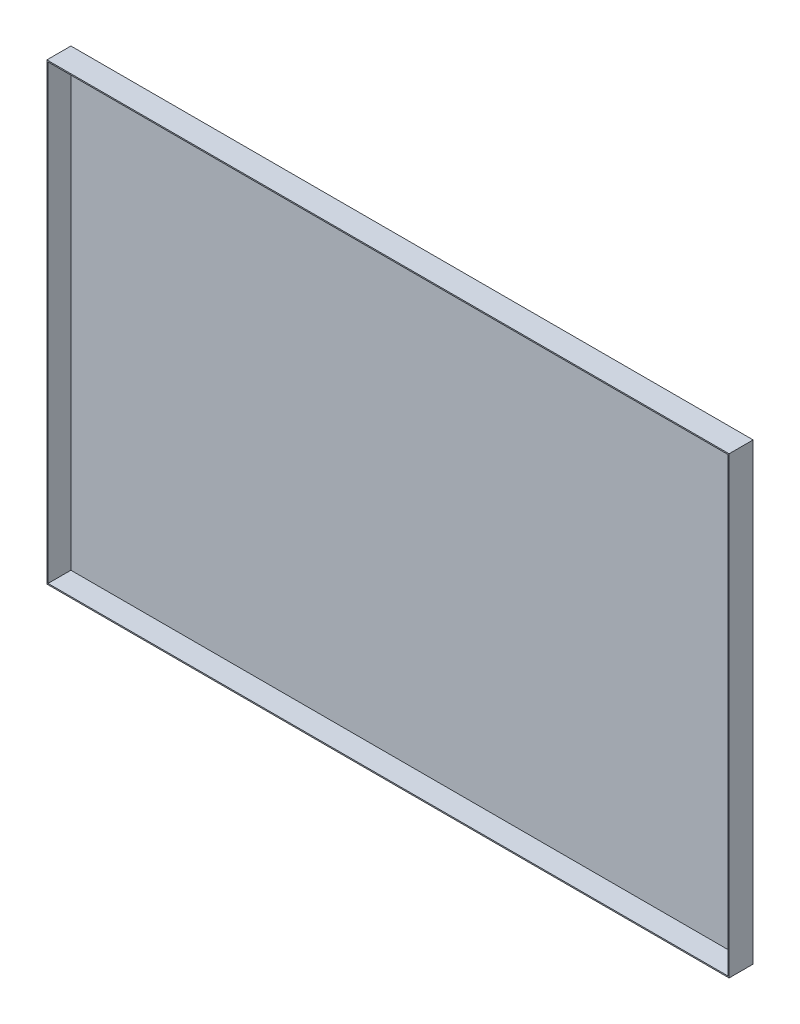
ISO-10303-21;
HEADER;
FILE_DESCRIPTION(('STEP AP214'),'2;1');
FILE_NAME('part.step','',(''),(''),'','','');
FILE_SCHEMA(('AUTOMOTIVE_DESIGN { 1 0 10303 214 1 1 1 1 }'));
ENDSEC;
DATA;
#1=APPLICATION_CONTEXT('core data for automotive mechanical design processes');
#2=APPLICATION_PROTOCOL_DEFINITION('international standard','automotive_design',2000,#1);
#3=PRODUCT_CONTEXT('',#1,'mechanical');
#4=PRODUCT('Part','Part','',(#3));
#5=PRODUCT_RELATED_PRODUCT_CATEGORY('part','',(#4));
#6=PRODUCT_DEFINITION_FORMATION('','',#4);
#7=PRODUCT_DEFINITION_CONTEXT('part definition',#1,'design');
#8=PRODUCT_DEFINITION('design','',#6,#7);
#9=PRODUCT_DEFINITION_SHAPE('','',#8);
#10=(LENGTH_UNIT() NAMED_UNIT(*) SI_UNIT(.MILLI.,.METRE.));
#11=(NAMED_UNIT(*) PLANE_ANGLE_UNIT() SI_UNIT($,.RADIAN.));
#12=(NAMED_UNIT(*) SI_UNIT($,.STERADIAN.) SOLID_ANGLE_UNIT());
#13=UNCERTAINTY_MEASURE_WITH_UNIT(LENGTH_MEASURE(1.E-05),#10,'distance_accuracy_value','');
#14=(GEOMETRIC_REPRESENTATION_CONTEXT(3) GLOBAL_UNCERTAINTY_ASSIGNED_CONTEXT((#13)) GLOBAL_UNIT_ASSIGNED_CONTEXT((#10,
#11,#12)) REPRESENTATION_CONTEXT('',''));
#15=CARTESIAN_POINT('',(0.,0.,0.));
#16=DIRECTION('',(0.,0.,1.));
#17=DIRECTION('',(1.,0.,0.));
#18=AXIS2_PLACEMENT_3D('',#15,#16,#17);
#19=CARTESIAN_POINT('',(284.,189.,20.));
#20=DIRECTION('',(-1.,0.,0.));
#21=DIRECTION('',(0.,0.,1.));
#22=AXIS2_PLACEMENT_3D('',#19,#20,#21);
#23=PLANE('',#22);
#24=DIRECTION('',(0.,1.,0.));
#25=VECTOR('',#24,1.);
#26=CARTESIAN_POINT('',(284.,189.,0.));
#27=LINE('',#26,#25);
#28=CARTESIAN_POINT('',(284.,-189.,0.));
#29=VERTEX_POINT('',#28);
#30=CARTESIAN_POINT('',(284.,189.,0.));
#31=VERTEX_POINT('',#30);
#32=EDGE_CURVE('E167',#29,#31,#27,.T.);
#33=ORIENTED_EDGE('',*,*,#32,.T.);
#34=DIRECTION('',(0.,0.,-1.));
#35=VECTOR('',#34,1.);
#36=CARTESIAN_POINT('',(284.,189.,20.));
#37=LINE('',#36,#35);
#38=CARTESIAN_POINT('',(284.,189.,20.));
#39=VERTEX_POINT('',#38);
#40=EDGE_CURVE('E11',#39,#31,#37,.T.);
#41=ORIENTED_EDGE('',*,*,#40,.F.);
#42=DIRECTION('',(0.,1.,0.));
#43=VECTOR('',#42,1.);
#44=CARTESIAN_POINT('',(284.,189.,20.));
#45=LINE('',#44,#43);
#46=CARTESIAN_POINT('',(284.,-189.,20.));
#47=VERTEX_POINT('',#46);
#48=EDGE_CURVE('E156',#47,#39,#45,.T.);
#49=ORIENTED_EDGE('',*,*,#48,.F.);
#50=DIRECTION('',(0.,0.,-1.));
#51=VECTOR('',#50,1.);
#52=CARTESIAN_POINT('',(284.,-189.,20.));
#53=LINE('',#52,#51);
#54=EDGE_CURVE('E166',#47,#29,#53,.T.);
#55=ORIENTED_EDGE('',*,*,#54,.T.);
#56=EDGE_LOOP('',(#33,#41,#49,#55));
#57=FACE_BOUND('',#56,.T.);
#58=ADVANCED_FACE('F39',(#57),#23,.F.);
#59=CARTESIAN_POINT('',(-284.,189.,20.));
#60=DIRECTION('',(0.,-1.,0.));
#61=DIRECTION('',(0.,0.,-1.));
#62=AXIS2_PLACEMENT_3D('',#59,#60,#61);
#63=PLANE('',#62);
#64=DIRECTION('',(-1.,0.,0.));
#65=VECTOR('',#64,1.);
#66=CARTESIAN_POINT('',(-284.,189.,0.));
#67=LINE('',#66,#65);
#68=CARTESIAN_POINT('',(-284.,189.,0.));
#69=VERTEX_POINT('',#68);
#70=EDGE_CURVE('E171',#31,#69,#67,.T.);
#71=ORIENTED_EDGE('',*,*,#70,.T.);
#72=DIRECTION('',(0.,0.,-1.));
#73=VECTOR('',#72,1.);
#74=CARTESIAN_POINT('',(-284.,189.,20.));
#75=LINE('',#74,#73);
#76=CARTESIAN_POINT('',(-284.,189.,20.));
#77=VERTEX_POINT('',#76);
#78=EDGE_CURVE('E47',#77,#69,#75,.T.);
#79=ORIENTED_EDGE('',*,*,#78,.F.);
#80=DIRECTION('',(-1.,0.,0.));
#81=VECTOR('',#80,1.);
#82=CARTESIAN_POINT('',(-284.,189.,20.));
#83=LINE('',#82,#81);
#84=EDGE_CURVE('E91',#39,#77,#83,.T.);
#85=ORIENTED_EDGE('',*,*,#84,.F.);
#86=ORIENTED_EDGE('',*,*,#40,.T.);
#87=EDGE_LOOP('',(#71,#79,#85,#86));
#88=FACE_BOUND('',#87,.T.);
#89=ADVANCED_FACE('F206',(#88),#63,.F.);
#90=CARTESIAN_POINT('',(-284.,189.,20.));
#91=DIRECTION('',(1.,0.,0.));
#92=DIRECTION('',(0.,1.,0.));
#93=AXIS2_PLACEMENT_3D('',#90,#91,#92);
#94=PLANE('',#93);
#95=DIRECTION('',(0.,-1.,0.));
#96=VECTOR('',#95,1.);
#97=CARTESIAN_POINT('',(-284.,189.,0.));
#98=LINE('',#97,#96);
#99=CARTESIAN_POINT('',(-284.,-189.,0.));
#100=VERTEX_POINT('',#99);
#101=EDGE_CURVE('E174',#69,#100,#98,.T.);
#102=ORIENTED_EDGE('',*,*,#101,.T.);
#103=DIRECTION('',(0.,0.,-1.));
#104=VECTOR('',#103,1.);
#105=CARTESIAN_POINT('',(-284.,-189.,20.));
#106=LINE('',#105,#104);
#107=CARTESIAN_POINT('',(-284.,-189.,20.));
#108=VERTEX_POINT('',#107);
#109=EDGE_CURVE('E181',#108,#100,#106,.T.);
#110=ORIENTED_EDGE('',*,*,#109,.F.);
#111=DIRECTION('',(0.,-1.,0.));
#112=VECTOR('',#111,1.);
#113=CARTESIAN_POINT('',(-284.,189.,20.));
#114=LINE('',#113,#112);
#115=EDGE_CURVE('E161',#77,#108,#114,.T.);
#116=ORIENTED_EDGE('',*,*,#115,.F.);
#117=ORIENTED_EDGE('',*,*,#78,.T.);
#118=EDGE_LOOP('',(#102,#110,#116,#117));
#119=FACE_BOUND('',#118,.T.);
#120=ADVANCED_FACE('F188',(#119),#94,.F.);
#121=CARTESIAN_POINT('',(-284.,-189.,20.));
#122=DIRECTION('',(0.,1.,0.));
#123=DIRECTION('',(0.,0.,1.));
#124=AXIS2_PLACEMENT_3D('',#121,#122,#123);
#125=PLANE('',#124);
#126=DIRECTION('',(1.,0.,0.));
#127=VECTOR('',#126,1.);
#128=CARTESIAN_POINT('',(-284.,-189.,0.));
#129=LINE('',#128,#127);
#130=EDGE_CURVE('E84',#100,#29,#129,.T.);
#131=ORIENTED_EDGE('',*,*,#130,.T.);
#132=ORIENTED_EDGE('',*,*,#54,.F.);
#133=DIRECTION('',(1.,0.,0.));
#134=VECTOR('',#133,1.);
#135=CARTESIAN_POINT('',(-284.,-189.,20.));
#136=LINE('',#135,#134);
#137=EDGE_CURVE('E63',#108,#47,#136,.T.);
#138=ORIENTED_EDGE('',*,*,#137,.F.);
#139=ORIENTED_EDGE('',*,*,#109,.T.);
#140=EDGE_LOOP('',(#131,#132,#138,#139));
#141=FACE_BOUND('',#140,.T.);
#142=ADVANCED_FACE('F196',(#141),#125,.F.);
#143=CARTESIAN_POINT('',(0.,0.,20.));
#144=DIRECTION('',(0.,0.,1.));
#145=DIRECTION('',(1.,0.,0.));
#146=AXIS2_PLACEMENT_3D('',#143,#144,#145);
#147=PLANE('',#146);
#148=DIRECTION('',(0.,1.,0.));
#149=VECTOR('',#148,1.);
#150=CARTESIAN_POINT('',(283.,189.,20.));
#151=LINE('',#150,#149);
#152=CARTESIAN_POINT('',(283.,-188.,20.));
#153=VERTEX_POINT('',#152);
#154=CARTESIAN_POINT('',(283.,188.,20.));
#155=VERTEX_POINT('',#154);
#156=EDGE_CURVE('E140',#153,#155,#151,.T.);
#157=ORIENTED_EDGE('',*,*,#156,.F.);
#158=DIRECTION('',(1.,0.,0.));
#159=VECTOR('',#158,1.);
#160=CARTESIAN_POINT('',(-284.,-188.,20.));
#161=LINE('',#160,#159);
#162=CARTESIAN_POINT('',(-283.,-188.,20.));
#163=VERTEX_POINT('',#162);
#164=EDGE_CURVE('E153',#163,#153,#161,.T.);
#165=ORIENTED_EDGE('',*,*,#164,.F.);
#166=DIRECTION('',(0.,-1.,0.));
#167=VECTOR('',#166,1.);
#168=CARTESIAN_POINT('',(-283.,189.,20.));
#169=LINE('',#168,#167);
#170=CARTESIAN_POINT('',(-283.,188.,20.));
#171=VERTEX_POINT('',#170);
#172=EDGE_CURVE('E150',#171,#163,#169,.T.);
#173=ORIENTED_EDGE('',*,*,#172,.F.);
#174=DIRECTION('',(-1.,0.,0.));
#175=VECTOR('',#174,1.);
#176=CARTESIAN_POINT('',(-284.,188.,20.));
#177=LINE('',#176,#175);
#178=EDGE_CURVE('E129',#155,#171,#177,.T.);
#179=ORIENTED_EDGE('',*,*,#178,.F.);
#180=EDGE_LOOP('',(#157,#165,#173,#179));
#181=FACE_BOUND('',#180,.T.);
#182=ORIENTED_EDGE('',*,*,#48,.T.);
#183=ORIENTED_EDGE('',*,*,#84,.T.);
#184=ORIENTED_EDGE('',*,*,#115,.T.);
#185=ORIENTED_EDGE('',*,*,#137,.T.);
#186=EDGE_LOOP('',(#182,#183,#184,#185));
#187=FACE_BOUND('',#186,.T.);
#188=ADVANCED_FACE('F198',(#181,#187),#147,.T.);
#189=CARTESIAN_POINT('',(0.,0.,0.));
#190=DIRECTION('',(0.,0.,1.));
#191=DIRECTION('',(1.,0.,0.));
#192=AXIS2_PLACEMENT_3D('',#189,#190,#191);
#193=PLANE('',#192);
#194=ORIENTED_EDGE('',*,*,#32,.F.);
#195=ORIENTED_EDGE('',*,*,#130,.F.);
#196=ORIENTED_EDGE('',*,*,#101,.F.);
#197=ORIENTED_EDGE('',*,*,#70,.F.);
#198=EDGE_LOOP('',(#194,#195,#196,#197));
#199=FACE_BOUND('',#198,.T.);
#200=ADVANCED_FACE('F192',(#199),#193,.F.);
#201=CARTESIAN_POINT('',(283.,189.,20.));
#202=DIRECTION('',(-1.,0.,0.));
#203=DIRECTION('',(0.,0.,1.));
#204=AXIS2_PLACEMENT_3D('',#201,#202,#203);
#205=PLANE('',#204);
#206=DIRECTION('',(0.,1.,0.));
#207=VECTOR('',#206,1.);
#208=CARTESIAN_POINT('',(283.,189.,1.));
#209=LINE('',#208,#207);
#210=CARTESIAN_POINT('',(283.,-188.,1.));
#211=VERTEX_POINT('',#210);
#212=CARTESIAN_POINT('',(283.,188.,1.));
#213=VERTEX_POINT('',#212);
#214=EDGE_CURVE('E119',#211,#213,#209,.T.);
#215=ORIENTED_EDGE('',*,*,#214,.F.);
#216=DIRECTION('',(0.,0.,-1.));
#217=VECTOR('',#216,1.);
#218=CARTESIAN_POINT('',(283.,-188.,20.));
#219=LINE('',#218,#217);
#220=EDGE_CURVE('E144',#153,#211,#219,.T.);
#221=ORIENTED_EDGE('',*,*,#220,.F.);
#222=ORIENTED_EDGE('',*,*,#156,.T.);
#223=DIRECTION('',(0.,0.,-1.));
#224=VECTOR('',#223,1.);
#225=CARTESIAN_POINT('',(283.,188.,20.));
#226=LINE('',#225,#224);
#227=EDGE_CURVE('E133',#155,#213,#226,.T.);
#228=ORIENTED_EDGE('',*,*,#227,.T.);
#229=EDGE_LOOP('',(#215,#221,#222,#228));
#230=FACE_BOUND('',#229,.T.);
#231=ADVANCED_FACE('F233',(#230),#205,.T.);
#232=CARTESIAN_POINT('',(-284.,188.,20.));
#233=DIRECTION('',(0.,-1.,0.));
#234=DIRECTION('',(0.,0.,-1.));
#235=AXIS2_PLACEMENT_3D('',#232,#233,#234);
#236=PLANE('',#235);
#237=DIRECTION('',(-1.,0.,0.));
#238=VECTOR('',#237,1.);
#239=CARTESIAN_POINT('',(-284.,188.,1.));
#240=LINE('',#239,#238);
#241=CARTESIAN_POINT('',(-283.,188.,1.));
#242=VERTEX_POINT('',#241);
#243=EDGE_CURVE('E113',#213,#242,#240,.T.);
#244=ORIENTED_EDGE('',*,*,#243,.F.);
#245=ORIENTED_EDGE('',*,*,#227,.F.);
#246=ORIENTED_EDGE('',*,*,#178,.T.);
#247=DIRECTION('',(0.,0.,-1.));
#248=VECTOR('',#247,1.);
#249=CARTESIAN_POINT('',(-283.,188.,20.));
#250=LINE('',#249,#248);
#251=EDGE_CURVE('E126',#171,#242,#250,.T.);
#252=ORIENTED_EDGE('',*,*,#251,.T.);
#253=EDGE_LOOP('',(#244,#245,#246,#252));
#254=FACE_BOUND('',#253,.T.);
#255=ADVANCED_FACE('F127',(#254),#236,.T.);
#256=CARTESIAN_POINT('',(-283.,189.,20.));
#257=DIRECTION('',(1.,0.,0.));
#258=DIRECTION('',(0.,1.,0.));
#259=AXIS2_PLACEMENT_3D('',#256,#257,#258);
#260=PLANE('',#259);
#261=DIRECTION('',(0.,-1.,0.));
#262=VECTOR('',#261,1.);
#263=CARTESIAN_POINT('',(-283.,189.,1.));
#264=LINE('',#263,#262);
#265=CARTESIAN_POINT('',(-283.,-188.,1.));
#266=VERTEX_POINT('',#265);
#267=EDGE_CURVE('E117',#242,#266,#264,.T.);
#268=ORIENTED_EDGE('',*,*,#267,.F.);
#269=ORIENTED_EDGE('',*,*,#251,.F.);
#270=ORIENTED_EDGE('',*,*,#172,.T.);
#271=DIRECTION('',(0.,0.,-1.));
#272=VECTOR('',#271,1.);
#273=CARTESIAN_POINT('',(-283.,-188.,20.));
#274=LINE('',#273,#272);
#275=EDGE_CURVE('E54',#163,#266,#274,.T.);
#276=ORIENTED_EDGE('',*,*,#275,.T.);
#277=EDGE_LOOP('',(#268,#269,#270,#276));
#278=FACE_BOUND('',#277,.T.);
#279=ADVANCED_FACE('F135',(#278),#260,.T.);
#280=CARTESIAN_POINT('',(-284.,-188.,20.));
#281=DIRECTION('',(0.,1.,0.));
#282=DIRECTION('',(0.,0.,1.));
#283=AXIS2_PLACEMENT_3D('',#280,#281,#282);
#284=PLANE('',#283);
#285=DIRECTION('',(1.,0.,0.));
#286=VECTOR('',#285,1.);
#287=CARTESIAN_POINT('',(-284.,-188.,1.));
#288=LINE('',#287,#286);
#289=EDGE_CURVE('E137',#266,#211,#288,.T.);
#290=ORIENTED_EDGE('',*,*,#289,.F.);
#291=ORIENTED_EDGE('',*,*,#275,.F.);
#292=ORIENTED_EDGE('',*,*,#164,.T.);
#293=ORIENTED_EDGE('',*,*,#220,.T.);
#294=EDGE_LOOP('',(#290,#291,#292,#293));
#295=FACE_BOUND('',#294,.T.);
#296=ADVANCED_FACE('F263',(#295),#284,.T.);
#297=CARTESIAN_POINT('',(0.,0.,1.));
#298=DIRECTION('',(0.,0.,1.));
#299=DIRECTION('',(1.,0.,0.));
#300=AXIS2_PLACEMENT_3D('',#297,#298,#299);
#301=PLANE('',#300);
#302=ORIENTED_EDGE('',*,*,#214,.T.);
#303=ORIENTED_EDGE('',*,*,#243,.T.);
#304=ORIENTED_EDGE('',*,*,#267,.T.);
#305=ORIENTED_EDGE('',*,*,#289,.T.);
#306=EDGE_LOOP('',(#302,#303,#304,#305));
#307=FACE_BOUND('',#306,.T.);
#308=ADVANCED_FACE('F115',(#307),#301,.T.);
#309=CLOSED_SHELL('',(#58,#89,#120,#142,#188,#200,#231,#255,#279,#296,#308));
#310=MANIFOLD_SOLID_BREP('B2',#309);
#311=ADVANCED_BREP_SHAPE_REPRESENTATION('',(#18,#310),#14);
#312=SHAPE_DEFINITION_REPRESENTATION(#9,#311);
ENDSEC;
END-ISO-10303-21;
